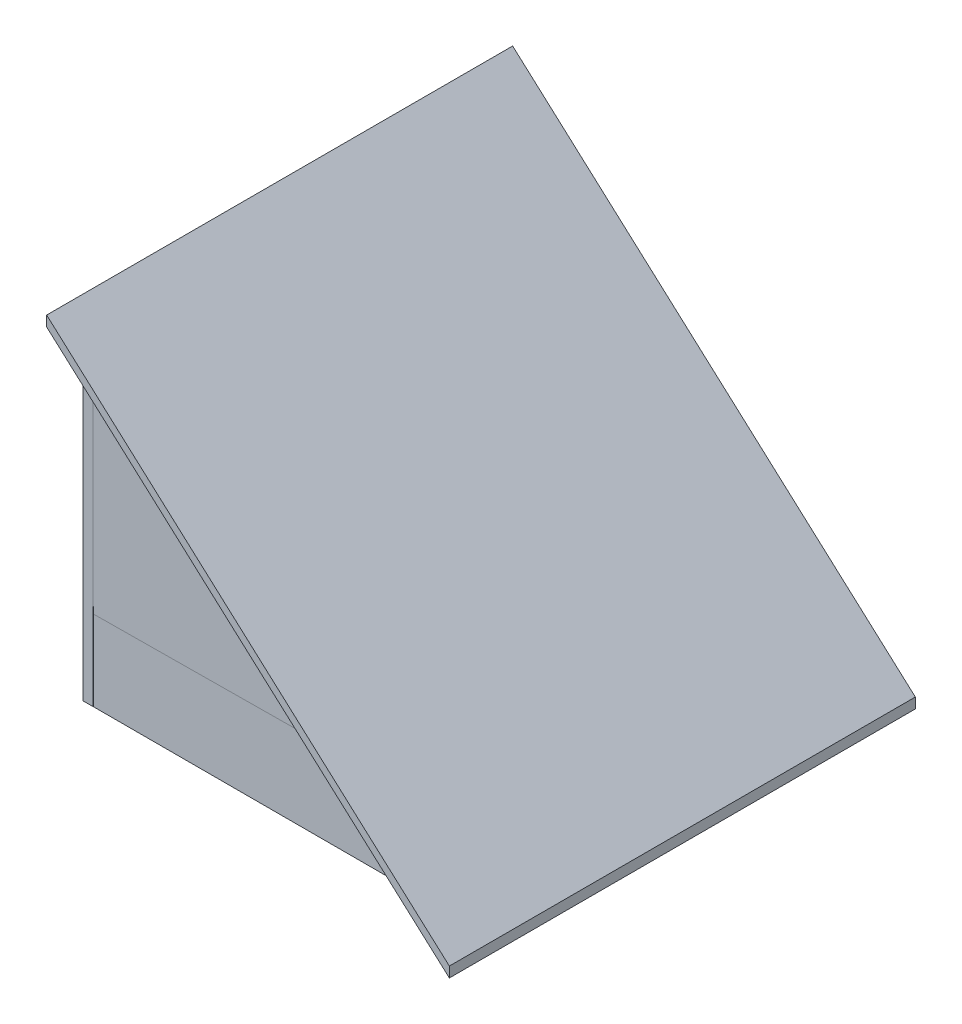
ISO-10303-21;
HEADER;
FILE_DESCRIPTION(('STEP AP214'),'2;1');
FILE_NAME('part.step','',(''),(''),'','','');
FILE_SCHEMA(('AUTOMOTIVE_DESIGN { 1 0 10303 214 1 1 1 1 }'));
ENDSEC;
DATA;
#1=APPLICATION_CONTEXT('core data for automotive mechanical design processes');
#2=APPLICATION_PROTOCOL_DEFINITION('international standard','automotive_design',2000,#1);
#3=PRODUCT_CONTEXT('',#1,'mechanical');
#4=PRODUCT('Part','Part','',(#3));
#5=PRODUCT_RELATED_PRODUCT_CATEGORY('part','',(#4));
#6=PRODUCT_DEFINITION_FORMATION('','',#4);
#7=PRODUCT_DEFINITION_CONTEXT('part definition',#1,'design');
#8=PRODUCT_DEFINITION('design','',#6,#7);
#9=PRODUCT_DEFINITION_SHAPE('','',#8);
#10=(LENGTH_UNIT() NAMED_UNIT(*) SI_UNIT(.MILLI.,.METRE.));
#11=(NAMED_UNIT(*) PLANE_ANGLE_UNIT() SI_UNIT($,.RADIAN.));
#12=(NAMED_UNIT(*) SI_UNIT($,.STERADIAN.) SOLID_ANGLE_UNIT());
#13=UNCERTAINTY_MEASURE_WITH_UNIT(LENGTH_MEASURE(1.E-05),#10,'distance_accuracy_value','');
#14=(GEOMETRIC_REPRESENTATION_CONTEXT(3) GLOBAL_UNCERTAINTY_ASSIGNED_CONTEXT((#13)) GLOBAL_UNIT_ASSIGNED_CONTEXT((#10,
#11,#12)) REPRESENTATION_CONTEXT('',''));
#15=CARTESIAN_POINT('',(0.,0.,0.));
#16=DIRECTION('',(0.,0.,1.));
#17=DIRECTION('',(1.,0.,0.));
#18=AXIS2_PLACEMENT_3D('',#15,#16,#17);
#19=CARTESIAN_POINT('',(92.8991489361703,7.62,69.8450593905439));
#20=DIRECTION('',(0.,0.,-1.));
#21=DIRECTION('',(-1.,0.,0.));
#22=AXIS2_PLACEMENT_3D('',#19,#20,#21);
#23=PLANE('',#22);
#24=DIRECTION('',(-1.,0.,0.));
#25=VECTOR('',#24,1.);
#26=CARTESIAN_POINT('',(92.8991489361703,-12.7,69.8450593905439));
#27=LINE('',#26,#25);
#28=CARTESIAN_POINT('',(92.8991489361703,-12.7,69.8450593905439));
#29=VERTEX_POINT('',#28);
#30=CARTESIAN_POINT('',(26.8591489361702,-12.7,69.8450593905439));
#31=VERTEX_POINT('',#30);
#32=EDGE_CURVE('E446',#29,#31,#27,.T.);
#33=ORIENTED_EDGE('',*,*,#32,.T.);
#34=DIRECTION('',(0.,-1.,0.));
#35=VECTOR('',#34,1.);
#36=CARTESIAN_POINT('',(26.8591489361702,7.62,69.8450593905439));
#37=LINE('',#36,#35);
#38=CARTESIAN_POINT('',(26.8591489361702,7.62,69.8450593905439));
#39=VERTEX_POINT('',#38);
#40=EDGE_CURVE('E50',#39,#31,#37,.T.);
#41=ORIENTED_EDGE('',*,*,#40,.F.);
#42=DIRECTION('',(1.,0.,0.));
#43=VECTOR('',#42,1.);
#44=CARTESIAN_POINT('',(92.8991489361703,7.62,69.8450593905439));
#45=LINE('',#44,#43);
#46=CARTESIAN_POINT('',(92.8991489361703,7.62,69.8450593905439));
#47=VERTEX_POINT('',#46);
#48=EDGE_CURVE('E443',#39,#47,#45,.T.);
#49=ORIENTED_EDGE('',*,*,#48,.T.);
#50=DIRECTION('',(0.,-1.,0.));
#51=VECTOR('',#50,1.);
#52=CARTESIAN_POINT('',(92.8991489361703,7.62,69.8450593905439));
#53=LINE('',#52,#51);
#54=EDGE_CURVE('E448',#47,#29,#53,.T.);
#55=ORIENTED_EDGE('',*,*,#54,.T.);
#56=EDGE_LOOP('',(#33,#41,#49,#55));
#57=FACE_BOUND('',#56,.T.);
#58=ADVANCED_FACE('F33',(#57),#23,.T.);
#59=CARTESIAN_POINT('',(24.3191489361702,0.,0.));
#60=DIRECTION('',(1.,0.,0.));
#61=DIRECTION('',(0.,0.,-1.));
#62=AXIS2_PLACEMENT_3D('',#59,#60,#61);
#63=PLANE('',#62);
#64=DIRECTION('',(0.,0.,-1.));
#65=VECTOR('',#64,1.);
#66=CARTESIAN_POINT('',(24.3191489361702,7.62,0.));
#67=LINE('',#66,#65);
#68=CARTESIAN_POINT('',(24.3191489361702,7.62,77.4653181557259));
#69=VERTEX_POINT('',#68);
#70=CARTESIAN_POINT('',(24.3191489361702,7.62,71.0236193905439));
#71=VERTEX_POINT('',#70);
#72=EDGE_CURVE('E417',#69,#71,#67,.T.);
#73=ORIENTED_EDGE('',*,*,#72,.T.);
#74=DIRECTION('',(0.,1.,0.));
#75=VECTOR('',#74,1.);
#76=CARTESIAN_POINT('',(24.3191489361702,7.62,71.0236193905439));
#77=LINE('',#76,#75);
#78=CARTESIAN_POINT('',(24.3191489361702,-12.7,71.0236193905439));
#79=VERTEX_POINT('',#78);
#80=EDGE_CURVE('E433',#79,#71,#77,.T.);
#81=ORIENTED_EDGE('',*,*,#80,.F.);
#82=DIRECTION('',(0.,0.,-1.));
#83=VECTOR('',#82,1.);
#84=CARTESIAN_POINT('',(24.3191489361702,-12.7,0.));
#85=LINE('',#84,#83);
#86=CARTESIAN_POINT('',(24.3191489361702,-12.7,72.2021793905439));
#87=VERTEX_POINT('',#86);
#88=EDGE_CURVE('E263',#87,#79,#85,.T.);
#89=ORIENTED_EDGE('',*,*,#88,.F.);
#90=DIRECTION('',(0.,-1.,0.));
#91=VECTOR('',#90,1.);
#92=CARTESIAN_POINT('',(24.3191489361702,-16.51,72.2021793905439));
#93=LINE('',#92,#91);
#94=CARTESIAN_POINT('',(24.3191489361702,-16.51,72.2021793905439));
#95=VERTEX_POINT('',#94);
#96=EDGE_CURVE('E411',#87,#95,#93,.T.);
#97=ORIENTED_EDGE('',*,*,#96,.T.);
#98=DIRECTION('',(0.,0.,1.));
#99=VECTOR('',#98,1.);
#100=CARTESIAN_POINT('',(24.3191489361702,-16.51,0.));
#101=LINE('',#100,#99);
#102=CARTESIAN_POINT('',(24.3191489361702,-16.51,74.7421793905439));
#103=VERTEX_POINT('',#102);
#104=EDGE_CURVE('E415',#95,#103,#101,.T.);
#105=ORIENTED_EDGE('',*,*,#104,.T.);
#106=DIRECTION('',(0.,-1.,0.));
#107=VECTOR('',#106,1.);
#108=CARTESIAN_POINT('',(24.3191489361702,-16.51,74.7421793905439));
#109=LINE('',#108,#107);
#110=CARTESIAN_POINT('',(24.3191489361702,-12.7,74.7421793905439));
#111=VERTEX_POINT('',#110);
#112=EDGE_CURVE('E384',#111,#103,#109,.T.);
#113=ORIENTED_EDGE('',*,*,#112,.F.);
#114=DIRECTION('',(0.,0.,-1.));
#115=VECTOR('',#114,1.);
#116=CARTESIAN_POINT('',(24.3191489361702,-12.7,0.));
#117=LINE('',#116,#115);
#118=CARTESIAN_POINT('',(24.3191489361702,-12.7,79.0324884998297));
#119=VERTEX_POINT('',#118);
#120=EDGE_CURVE('E58',#119,#111,#117,.T.);
#121=ORIENTED_EDGE('',*,*,#120,.F.);
#122=DIRECTION('',(0.,-1.,0.));
#123=VECTOR('',#122,1.);
#124=CARTESIAN_POINT('',(24.3191489361702,73.66,79.0324884998297));
#125=LINE('',#124,#123);
#126=CARTESIAN_POINT('',(24.3191489361702,73.66,79.0324884998297));
#127=VERTEX_POINT('',#126);
#128=EDGE_CURVE('E299',#127,#119,#125,.T.);
#129=ORIENTED_EDGE('',*,*,#128,.F.);
#130=DIRECTION('',(0.,0.,-1.));
#131=VECTOR('',#130,1.);
#132=CARTESIAN_POINT('',(24.3191489361702,73.66,80.0324884998297));
#133=LINE('',#132,#131);
#134=CARTESIAN_POINT('',(24.3191489361702,73.66,80.0324884998297));
#135=VERTEX_POINT('',#134);
#136=EDGE_CURVE('E301',#135,#127,#133,.T.);
#137=ORIENTED_EDGE('',*,*,#136,.F.);
#138=DIRECTION('',(0.,0.,1.));
#139=VECTOR('',#138,1.);
#140=CARTESIAN_POINT('',(24.3191489361703,73.66,91.4350593905439));
#141=LINE('',#140,#139);
#142=CARTESIAN_POINT('',(24.3191489361703,73.66,91.4350593905439));
#143=VERTEX_POINT('',#142);
#144=EDGE_CURVE('E11',#135,#143,#141,.T.);
#145=ORIENTED_EDGE('',*,*,#144,.T.);
#146=DIRECTION('',(0.,1.,0.));
#147=VECTOR('',#146,1.);
#148=CARTESIAN_POINT('',(24.3191489361702,-12.7,91.4350593905439));
#149=LINE('',#148,#147);
#150=CARTESIAN_POINT('',(24.3191489361703,76.2,91.4350593905439));
#151=VERTEX_POINT('',#150);
#152=EDGE_CURVE('E401',#143,#151,#149,.T.);
#153=ORIENTED_EDGE('',*,*,#152,.T.);
#154=DIRECTION('',(0.,0.,1.));
#155=VECTOR('',#154,1.);
#156=CARTESIAN_POINT('',(24.3191489361703,76.2,91.4350593905439));
#157=LINE('',#156,#155);
#158=CARTESIAN_POINT('',(24.3191489361702,76.1999999999999,-22.8649406094561));
#159=VERTEX_POINT('',#158);
#160=EDGE_CURVE('E466',#159,#151,#157,.T.);
#161=ORIENTED_EDGE('',*,*,#160,.F.);
#162=DIRECTION('',(0.,-1.,0.));
#163=VECTOR('',#162,1.);
#164=CARTESIAN_POINT('',(24.3191489361702,-12.7,-22.8649406094561));
#165=LINE('',#164,#163);
#166=CARTESIAN_POINT('',(24.3191489361702,73.6599999999999,-22.8649406094561));
#167=VERTEX_POINT('',#166);
#168=EDGE_CURVE('E397',#159,#167,#165,.T.);
#169=ORIENTED_EDGE('',*,*,#168,.T.);
#170=CARTESIAN_POINT('',(24.3191489361702,73.6599999999999,-21.594940609456));
#171=VERTEX_POINT('',#170);
#172=EDGE_CURVE('E500',#167,#171,#141,.T.);
#173=ORIENTED_EDGE('',*,*,#172,.T.);
#174=DIRECTION('',(0.,0.,-1.));
#175=VECTOR('',#174,1.);
#176=CARTESIAN_POINT('',(24.3191489361702,73.6599999999999,-21.594940609456));
#177=LINE('',#176,#175);
#178=CARTESIAN_POINT('',(24.3191489361702,73.6599999999999,-20.594940609456));
#179=VERTEX_POINT('',#178);
#180=EDGE_CURVE('E274',#179,#171,#177,.T.);
#181=ORIENTED_EDGE('',*,*,#180,.F.);
#182=DIRECTION('',(0.,1.,0.));
#183=VECTOR('',#182,1.);
#184=CARTESIAN_POINT('',(24.3191489361702,73.6599999999999,-20.594940609456));
#185=LINE('',#184,#183);
#186=CARTESIAN_POINT('',(24.3191489361702,-12.7,-20.594940609456));
#187=VERTEX_POINT('',#186);
#188=EDGE_CURVE('E265',#187,#179,#185,.T.);
#189=ORIENTED_EDGE('',*,*,#188,.F.);
#190=CARTESIAN_POINT('',(24.3191489361702,-12.7,-17.3968266094561));
#191=VERTEX_POINT('',#190);
#192=EDGE_CURVE('E418',#191,#187,#117,.T.);
#193=ORIENTED_EDGE('',*,*,#192,.F.);
#194=DIRECTION('',(0.,1.,0.));
#195=VECTOR('',#194,1.);
#196=CARTESIAN_POINT('',(24.3191489361702,-16.51,-17.3968266094561));
#197=LINE('',#196,#195);
#198=CARTESIAN_POINT('',(24.3191489361702,-16.51,-17.3968266094561));
#199=VERTEX_POINT('',#198);
#200=EDGE_CURVE('E410',#199,#191,#197,.T.);
#201=ORIENTED_EDGE('',*,*,#200,.F.);
#202=CARTESIAN_POINT('',(24.3191489361702,-16.51,-14.8568266094561));
#203=VERTEX_POINT('',#202);
#204=EDGE_CURVE('E404',#199,#203,#101,.T.);
#205=ORIENTED_EDGE('',*,*,#204,.T.);
#206=DIRECTION('',(0.,1.,0.));
#207=VECTOR('',#206,1.);
#208=CARTESIAN_POINT('',(24.3191489361702,-16.51,-14.8568266094561));
#209=LINE('',#208,#207);
#210=CARTESIAN_POINT('',(24.3191489361702,-12.7,-14.8568266094561));
#211=VERTEX_POINT('',#210);
#212=EDGE_CURVE('E414',#203,#211,#209,.T.);
#213=ORIENTED_EDGE('',*,*,#212,.T.);
#214=CARTESIAN_POINT('',(24.3191489361702,-12.7,-13.9749406094561));
#215=VERTEX_POINT('',#214);
#216=EDGE_CURVE('E383',#215,#211,#85,.T.);
#217=ORIENTED_EDGE('',*,*,#216,.F.);
#218=DIRECTION('',(0.,1.,0.));
#219=VECTOR('',#218,1.);
#220=CARTESIAN_POINT('',(24.3191489361702,7.62,-13.9749406094561));
#221=LINE('',#220,#219);
#222=CARTESIAN_POINT('',(24.3191489361702,7.62,-13.9749406094561));
#223=VERTEX_POINT('',#222);
#224=EDGE_CURVE('E425',#215,#223,#221,.T.);
#225=ORIENTED_EDGE('',*,*,#224,.T.);
#226=CARTESIAN_POINT('',(24.3191489361702,7.62,-19.0549406094561));
#227=VERTEX_POINT('',#226);
#228=EDGE_CURVE('E385',#223,#227,#67,.T.);
#229=ORIENTED_EDGE('',*,*,#228,.T.);
#230=DIRECTION('',(0.,1.,0.));
#231=VECTOR('',#230,1.);
#232=CARTESIAN_POINT('',(24.3191489361702,0.,-19.0549406094561));
#233=LINE('',#232,#231);
#234=CARTESIAN_POINT('',(24.3191489361702,73.6599999999999,-19.0549406094561));
#235=VERTEX_POINT('',#234);
#236=EDGE_CURVE('E405',#227,#235,#233,.T.);
#237=ORIENTED_EDGE('',*,*,#236,.T.);
#238=CARTESIAN_POINT('',(24.3191489361703,73.66,77.4924884998297));
#239=VERTEX_POINT('',#238);
#240=EDGE_CURVE('E42',#235,#239,#141,.T.);
#241=ORIENTED_EDGE('',*,*,#240,.T.);
#242=DIRECTION('',(0.,-0.99999991536576,-0.00041142249855091));
#243=VECTOR('',#242,1.);
#244=CARTESIAN_POINT('',(24.3191489361702,-0.0329146952814137,77.4621695741743));
#245=LINE('',#244,#243);
#246=EDGE_CURVE('E400',#239,#69,#245,.T.);
#247=ORIENTED_EDGE('',*,*,#246,.T.);
#248=EDGE_LOOP('',(#73,#81,#89,#97,#105,#113,#121,#129,#137,#145,#153,#161,#169,#173,#181,#189,
#193,#201,#205,#213,#217,#225,#229,#237,#241,#247));
#249=FACE_BOUND('',#248,.T.);
#250=ADVANCED_FACE('F35',(#249),#63,.F.);
#251=CARTESIAN_POINT('',(48.7726578112144,51.6518420124604,0.));
#252=DIRECTION('',(0.66896473162245,0.743294146247166,0.));
#253=DIRECTION('',(-0.743294146247166,0.66896473162245,0.));
#254=AXIS2_PLACEMENT_3D('',#251,#252,#253);
#255=PLANE('',#254);
#256=DIRECTION('',(-0.743294146247166,0.66896473162245,0.));
#257=VECTOR('',#256,1.);
#258=CARTESIAN_POINT('',(15.0572704831317,81.9956906077349,-21.5949406094561));
#259=LINE('',#258,#257);
#260=CARTESIAN_POINT('',(100.51914893617,5.0800000000001,-21.5949406094561));
#261=VERTEX_POINT('',#260);
#262=EDGE_CURVE('E526',#261,#171,#259,.T.);
#263=ORIENTED_EDGE('',*,*,#262,.T.);
#264=ORIENTED_EDGE('',*,*,#172,.F.);
#265=DIRECTION('',(0.743294146247166,-0.66896473162245,0.));
#266=VECTOR('',#265,1.);
#267=CARTESIAN_POINT('',(24.3191489361703,73.66,-22.8649406094561));
#268=LINE('',#267,#266);
#269=CARTESIAN_POINT('',(123.096926713948,-15.24,-22.8649406094561));
#270=VERTEX_POINT('',#269);
#271=EDGE_CURVE('E527',#167,#270,#268,.T.);
#272=ORIENTED_EDGE('',*,*,#271,.T.);
#273=DIRECTION('',(0.,0.,1.));
#274=VECTOR('',#273,1.);
#275=CARTESIAN_POINT('',(123.096926713948,-15.24,91.4350593905439));
#276=LINE('',#275,#274);
#277=CARTESIAN_POINT('',(123.096926713948,-15.24,91.4350593905439));
#278=VERTEX_POINT('',#277);
#279=EDGE_CURVE('E520',#270,#278,#276,.T.);
#280=ORIENTED_EDGE('',*,*,#279,.T.);
#281=DIRECTION('',(-0.743294146247166,0.66896473162245,0.));
#282=VECTOR('',#281,1.);
#283=CARTESIAN_POINT('',(24.3191489361703,73.66,91.4350593905439));
#284=LINE('',#283,#282);
#285=EDGE_CURVE('E508',#278,#143,#284,.T.);
#286=ORIENTED_EDGE('',*,*,#285,.T.);
#287=ORIENTED_EDGE('',*,*,#144,.F.);
#288=DIRECTION('',(-0.743294117556119,0.668964705800505,0.000277848364986755));
#289=VECTOR('',#288,1.);
#290=CARTESIAN_POINT('',(97.6969267139482,7.62,80.0050593905439));
#291=LINE('',#290,#289);
#292=CARTESIAN_POINT('',(97.6969267139481,7.62,80.0050593905439));
#293=VERTEX_POINT('',#292);
#294=EDGE_CURVE('E365',#293,#135,#291,.T.);
#295=ORIENTED_EDGE('',*,*,#294,.F.);
#296=DIRECTION('',(0.743294146247166,-0.66896473162245,0.));
#297=VECTOR('',#296,1.);
#298=CARTESIAN_POINT('',(15.0572704831317,81.9956906077349,80.0050593905439));
#299=LINE('',#298,#297);
#300=CARTESIAN_POINT('',(100.51914893617,5.0800000000001,80.0050593905439));
#301=VERTEX_POINT('',#300);
#302=EDGE_CURVE('E486',#293,#301,#299,.T.);
#303=ORIENTED_EDGE('',*,*,#302,.T.);
#304=DIRECTION('',(0.,0.,-1.));
#305=VECTOR('',#304,1.);
#306=CARTESIAN_POINT('',(100.51914893617,5.0800000000001,-21.5949406094561));
#307=LINE('',#306,#305);
#308=EDGE_CURVE('E420',#301,#261,#307,.T.);
#309=ORIENTED_EDGE('',*,*,#308,.T.);
#310=EDGE_LOOP('',(#263,#264,#272,#280,#286,#287,#295,#303,#309));
#311=FACE_BOUND('',#310,.T.);
#312=ADVANCED_FACE('F560',(#311),#255,.F.);
#313=CARTESIAN_POINT('',(0.,-12.7,0.));
#314=DIRECTION('',(0.,1.,0.));
#315=DIRECTION('',(0.,0.,1.));
#316=AXIS2_PLACEMENT_3D('',#313,#314,#315);
#317=PLANE('',#316);
#318=DIRECTION('',(-1.,0.,0.));
#319=VECTOR('',#318,1.);
#320=CARTESIAN_POINT('',(-51.8808510638297,-12.7,80.0050593905439));
#321=LINE('',#320,#319);
#322=CARTESIAN_POINT('',(100.51914893617,-12.7,80.0050593905439));
#323=VERTEX_POINT('',#322);
#324=CARTESIAN_POINT('',(24.3191489361702,-12.7,80.0050593905439));
#325=VERTEX_POINT('',#324);
#326=EDGE_CURVE('E454',#323,#325,#321,.T.);
#327=ORIENTED_EDGE('',*,*,#326,.T.);
#328=DIRECTION('',(0.,0.,1.));
#329=VECTOR('',#328,1.);
#330=CARTESIAN_POINT('',(24.3191489361702,-12.7,80.0324884998297));
#331=LINE('',#330,#329);
#332=CARTESIAN_POINT('',(24.3191489361702,-12.7,80.0324884998297));
#333=VERTEX_POINT('',#332);
#334=EDGE_CURVE('E292',#325,#333,#331,.T.);
#335=ORIENTED_EDGE('',*,*,#334,.T.);
#336=DIRECTION('',(1.,0.,0.));
#337=VECTOR('',#336,1.);
#338=CARTESIAN_POINT('',(21.7791489361702,-12.7,80.0324884998297));
#339=LINE('',#338,#337);
#340=CARTESIAN_POINT('',(21.7791489361702,-12.7,80.0324884998297));
#341=VERTEX_POINT('',#340);
#342=EDGE_CURVE('E298',#341,#333,#339,.T.);
#343=ORIENTED_EDGE('',*,*,#342,.F.);
#344=DIRECTION('',(0.,0.,1.));
#345=VECTOR('',#344,1.);
#346=CARTESIAN_POINT('',(21.7791489361702,-12.7,80.0324884998297));
#347=LINE('',#346,#345);
#348=CARTESIAN_POINT('',(21.7791489361702,-12.7,79.0324884998297));
#349=VERTEX_POINT('',#348);
#350=EDGE_CURVE('E296',#349,#341,#347,.T.);
#351=ORIENTED_EDGE('',*,*,#350,.F.);
#352=DIRECTION('',(1.,0.,0.));
#353=VECTOR('',#352,1.);
#354=CARTESIAN_POINT('',(21.7791489361702,-12.7,79.0324884998297));
#355=LINE('',#354,#353);
#356=EDGE_CURVE('E305',#349,#119,#355,.T.);
#357=ORIENTED_EDGE('',*,*,#356,.T.);
#358=ORIENTED_EDGE('',*,*,#120,.T.);
#359=DIRECTION('',(-1.,0.,0.));
#360=VECTOR('',#359,1.);
#361=CARTESIAN_POINT('',(97.4791489361702,-12.7,74.7421793905439));
#362=LINE('',#361,#360);
#363=CARTESIAN_POINT('',(97.4791489361702,-12.7,74.7421793905439));
#364=VERTEX_POINT('',#363);
#365=EDGE_CURVE('E355',#364,#111,#362,.T.);
#366=ORIENTED_EDGE('',*,*,#365,.F.);
#367=DIRECTION('',(0.,0.,1.));
#368=VECTOR('',#367,1.);
#369=CARTESIAN_POINT('',(97.4791489361702,-12.7,-17.3968266094561));
#370=LINE('',#369,#368);
#371=CARTESIAN_POINT('',(97.4791489361702,-12.7,-17.3968266094561));
#372=VERTEX_POINT('',#371);
#373=EDGE_CURVE('E342',#372,#364,#370,.T.);
#374=ORIENTED_EDGE('',*,*,#373,.F.);
#375=DIRECTION('',(1.,0.,0.));
#376=VECTOR('',#375,1.);
#377=CARTESIAN_POINT('',(97.4791489361702,-12.7,-17.3968266094561));
#378=LINE('',#377,#376);
#379=EDGE_CURVE('E347',#191,#372,#378,.T.);
#380=ORIENTED_EDGE('',*,*,#379,.F.);
#381=ORIENTED_EDGE('',*,*,#192,.T.);
#382=DIRECTION('',(1.,0.,0.));
#383=VECTOR('',#382,1.);
#384=CARTESIAN_POINT('',(21.7791489361702,-12.7,-20.594940609456));
#385=LINE('',#384,#383);
#386=CARTESIAN_POINT('',(21.7791489361702,-12.7,-20.594940609456));
#387=VERTEX_POINT('',#386);
#388=EDGE_CURVE('E285',#387,#187,#385,.T.);
#389=ORIENTED_EDGE('',*,*,#388,.F.);
#390=DIRECTION('',(0.,0.,1.));
#391=VECTOR('',#390,1.);
#392=CARTESIAN_POINT('',(21.7791489361702,-12.7,-21.594940609456));
#393=LINE('',#392,#391);
#394=CARTESIAN_POINT('',(21.7791489361702,-12.7,-21.594940609456));
#395=VERTEX_POINT('',#394);
#396=EDGE_CURVE('E273',#395,#387,#393,.T.);
#397=ORIENTED_EDGE('',*,*,#396,.F.);
#398=DIRECTION('',(1.,0.,0.));
#399=VECTOR('',#398,1.);
#400=CARTESIAN_POINT('',(-51.8808510638297,-12.7,-21.5949406094561));
#401=LINE('',#400,#399);
#402=CARTESIAN_POINT('',(100.51914893617,-12.7,-21.5949406094561));
#403=VERTEX_POINT('',#402);
#404=EDGE_CURVE('E452',#395,#403,#401,.T.);
#405=ORIENTED_EDGE('',*,*,#404,.T.);
#406=DIRECTION('',(0.,0.,1.));
#407=VECTOR('',#406,1.);
#408=CARTESIAN_POINT('',(100.51914893617,-12.7,-21.5949406094561));
#409=LINE('',#408,#407);
#410=EDGE_CURVE('E456',#403,#323,#409,.T.);
#411=ORIENTED_EDGE('',*,*,#410,.T.);
#412=EDGE_LOOP('',(#327,#335,#343,#351,#357,#358,#366,#374,#380,#381,#389,#397,#405,#411));
#413=FACE_BOUND('',#412,.T.);
#414=ADVANCED_FACE('F611',(#413),#317,.F.);
#415=CARTESIAN_POINT('',(-51.8808510638297,7.62,80.0050593905439));
#416=DIRECTION('',(0.,0.,-1.));
#417=DIRECTION('',(-1.,0.,0.));
#418=AXIS2_PLACEMENT_3D('',#415,#416,#417);
#419=PLANE('',#418);
#420=DIRECTION('',(0.999963267330155,0.00857111371997301,0.));
#421=VECTOR('',#420,1.);
#422=CARTESIAN_POINT('',(-50.4697399527186,6.34999999999996,80.0050593905439));
#423=LINE('',#422,#421);
#424=CARTESIAN_POINT('',(24.3191489361702,6.9910476190476,80.0050593905439));
#425=VERTEX_POINT('',#424);
#426=EDGE_CURVE('E368',#425,#293,#423,.T.);
#427=ORIENTED_EDGE('',*,*,#426,.F.);
#428=DIRECTION('',(0.,-1.,0.));
#429=VECTOR('',#428,1.);
#430=CARTESIAN_POINT('',(24.3191489361702,7.62,80.0050593905439));
#431=LINE('',#430,#429);
#432=EDGE_CURVE('E390',#425,#325,#431,.T.);
#433=ORIENTED_EDGE('',*,*,#432,.T.);
#434=ORIENTED_EDGE('',*,*,#326,.F.);
#435=DIRECTION('',(0.,-1.,0.));
#436=VECTOR('',#435,1.);
#437=CARTESIAN_POINT('',(100.51914893617,7.62,80.0050593905439));
#438=LINE('',#437,#436);
#439=EDGE_CURVE('E479',#301,#323,#438,.T.);
#440=ORIENTED_EDGE('',*,*,#439,.F.);
#441=ORIENTED_EDGE('',*,*,#302,.F.);
#442=EDGE_LOOP('',(#427,#433,#434,#440,#441));
#443=FACE_BOUND('',#442,.T.);
#444=ADVANCED_FACE('F604',(#443),#419,.F.);
#445=CARTESIAN_POINT('',(0.,7.62,0.));
#446=DIRECTION('',(0.,1.,0.));
#447=DIRECTION('',(0.,0.,1.));
#448=AXIS2_PLACEMENT_3D('',#445,#446,#447);
#449=PLANE('',#448);
#450=DIRECTION('',(-1.,0.,0.));
#451=VECTOR('',#450,1.);
#452=CARTESIAN_POINT('',(26.8591489361702,7.62,71.0236193905439));
#453=LINE('',#452,#451);
#454=CARTESIAN_POINT('',(26.8591489361702,7.62,71.0236193905439));
#455=VERTEX_POINT('',#454);
#456=EDGE_CURVE('E249',#455,#71,#453,.T.);
#457=ORIENTED_EDGE('',*,*,#456,.T.);
#458=ORIENTED_EDGE('',*,*,#72,.F.);
#459=DIRECTION('',(-0.999999999993782,0.,3.52647885741862E-06));
#460=VECTOR('',#459,1.);
#461=CARTESIAN_POINT('',(0.000273180109091904,7.62,77.4654039157271));
#462=LINE('',#461,#460);
#463=CARTESIAN_POINT('',(97.6969267139482,7.62,77.4650593905439));
#464=VERTEX_POINT('',#463);
#465=EDGE_CURVE('E377',#464,#69,#462,.T.);
#466=ORIENTED_EDGE('',*,*,#465,.F.);
#467=DIRECTION('',(0.,0.,-1.));
#468=VECTOR('',#467,1.);
#469=CARTESIAN_POINT('',(97.6969267139482,7.62,0.));
#470=LINE('',#469,#468);
#471=CARTESIAN_POINT('',(97.6969267139482,7.62,-19.0549406094561));
#472=VERTEX_POINT('',#471);
#473=EDGE_CURVE('E483',#464,#472,#470,.T.);
#474=ORIENTED_EDGE('',*,*,#473,.T.);
#475=DIRECTION('',(-1.,0.,0.));
#476=VECTOR('',#475,1.);
#477=CARTESIAN_POINT('',(97.6969267139482,7.62,-19.0549406094561));
#478=LINE('',#477,#476);
#479=EDGE_CURVE('E316',#472,#227,#478,.T.);
#480=ORIENTED_EDGE('',*,*,#479,.T.);
#481=ORIENTED_EDGE('',*,*,#228,.F.);
#482=DIRECTION('',(-1.,0.,0.));
#483=VECTOR('',#482,1.);
#484=CARTESIAN_POINT('',(-44.2608510638297,7.62,-13.9749406094561));
#485=LINE('',#484,#483);
#486=CARTESIAN_POINT('',(92.8991489361703,7.62,-13.9749406094561));
#487=VERTEX_POINT('',#486);
#488=EDGE_CURVE('E470',#487,#223,#485,.T.);
#489=ORIENTED_EDGE('',*,*,#488,.F.);
#490=DIRECTION('',(0.,0.,-1.));
#491=VECTOR('',#490,1.);
#492=CARTESIAN_POINT('',(92.8991489361703,7.62,-13.9749406094561));
#493=LINE('',#492,#491);
#494=EDGE_CURVE('E468',#47,#487,#493,.T.);
#495=ORIENTED_EDGE('',*,*,#494,.F.);
#496=ORIENTED_EDGE('',*,*,#48,.F.);
#497=DIRECTION('',(0.,0.,-1.));
#498=VECTOR('',#497,1.);
#499=CARTESIAN_POINT('',(26.8591489361702,7.62,69.8450593905439));
#500=LINE('',#499,#498);
#501=EDGE_CURVE('E251',#455,#39,#500,.T.);
#502=ORIENTED_EDGE('',*,*,#501,.F.);
#503=EDGE_LOOP('',(#457,#458,#466,#474,#480,#481,#489,#495,#496,#502));
#504=FACE_BOUND('',#503,.T.);
#505=ADVANCED_FACE('F438',(#504),#449,.T.);
#506=CARTESIAN_POINT('',(-51.8808510638297,7.62,-21.5949406094561));
#507=DIRECTION('',(0.,0.,1.));
#508=DIRECTION('',(1.,0.,0.));
#509=AXIS2_PLACEMENT_3D('',#506,#507,#508);
#510=PLANE('',#509);
#511=ORIENTED_EDGE('',*,*,#404,.F.);
#512=DIRECTION('',(0.,-1.,0.));
#513=VECTOR('',#512,1.);
#514=CARTESIAN_POINT('',(21.7791489361702,73.6599999999999,-21.594940609456));
#515=LINE('',#514,#513);
#516=CARTESIAN_POINT('',(21.7791489361702,73.6599999999999,-21.594940609456));
#517=VERTEX_POINT('',#516);
#518=EDGE_CURVE('E270',#517,#395,#515,.T.);
#519=ORIENTED_EDGE('',*,*,#518,.F.);
#520=DIRECTION('',(1.,0.,0.));
#521=VECTOR('',#520,1.);
#522=CARTESIAN_POINT('',(21.7791489361702,73.6599999999999,-21.594940609456));
#523=LINE('',#522,#521);
#524=EDGE_CURVE('E280',#517,#171,#523,.T.);
#525=ORIENTED_EDGE('',*,*,#524,.T.);
#526=ORIENTED_EDGE('',*,*,#262,.F.);
#527=DIRECTION('',(0.,-1.,0.));
#528=VECTOR('',#527,1.);
#529=CARTESIAN_POINT('',(100.51914893617,7.62,-21.5949406094561));
#530=LINE('',#529,#528);
#531=EDGE_CURVE('E476',#261,#403,#530,.T.);
#532=ORIENTED_EDGE('',*,*,#531,.T.);
#533=EDGE_LOOP('',(#511,#519,#525,#526,#532));
#534=FACE_BOUND('',#533,.T.);
#535=ADVANCED_FACE('F615',(#534),#510,.F.);
#536=CARTESIAN_POINT('',(100.51914893617,7.62,-21.5949406094561));
#537=DIRECTION('',(-1.,0.,0.));
#538=DIRECTION('',(0.,0.,1.));
#539=AXIS2_PLACEMENT_3D('',#536,#537,#538);
#540=PLANE('',#539);
#541=ORIENTED_EDGE('',*,*,#308,.F.);
#542=ORIENTED_EDGE('',*,*,#439,.T.);
#543=ORIENTED_EDGE('',*,*,#410,.F.);
#544=ORIENTED_EDGE('',*,*,#531,.F.);
#545=EDGE_LOOP('',(#541,#542,#543,#544));
#546=FACE_BOUND('',#545,.T.);
#547=ADVANCED_FACE('F609',(#546),#540,.F.);
#548=CARTESIAN_POINT('',(92.8991489361703,7.62,-13.9749406094561));
#549=DIRECTION('',(-1.,0.,0.));
#550=DIRECTION('',(0.,0.,1.));
#551=AXIS2_PLACEMENT_3D('',#548,#549,#550);
#552=PLANE('',#551);
#553=DIRECTION('',(0.,-1.,0.));
#554=VECTOR('',#553,1.);
#555=CARTESIAN_POINT('',(92.8991489361703,7.62,-13.9749406094561));
#556=LINE('',#555,#554);
#557=CARTESIAN_POINT('',(92.8991489361703,-12.7,-13.9749406094561));
#558=VERTEX_POINT('',#557);
#559=EDGE_CURVE('E472',#487,#558,#556,.T.);
#560=ORIENTED_EDGE('',*,*,#559,.T.);
#561=DIRECTION('',(0.,0.,1.));
#562=VECTOR('',#561,1.);
#563=CARTESIAN_POINT('',(92.8991489361703,-12.7,-13.9749406094561));
#564=LINE('',#563,#562);
#565=EDGE_CURVE('E463',#558,#29,#564,.T.);
#566=ORIENTED_EDGE('',*,*,#565,.T.);
#567=ORIENTED_EDGE('',*,*,#54,.F.);
#568=ORIENTED_EDGE('',*,*,#494,.T.);
#569=EDGE_LOOP('',(#560,#566,#567,#568));
#570=FACE_BOUND('',#569,.T.);
#571=ADVANCED_FACE('F622',(#570),#552,.T.);
#572=CARTESIAN_POINT('',(-44.2608510638297,7.62,-13.9749406094561));
#573=DIRECTION('',(0.,0.,1.));
#574=DIRECTION('',(1.,0.,0.));
#575=AXIS2_PLACEMENT_3D('',#572,#573,#574);
#576=PLANE('',#575);
#577=ORIENTED_EDGE('',*,*,#224,.F.);
#578=DIRECTION('',(1.,0.,0.));
#579=VECTOR('',#578,1.);
#580=CARTESIAN_POINT('',(-44.2608510638297,-12.7,-13.9749406094561));
#581=LINE('',#580,#579);
#582=EDGE_CURVE('E451',#215,#558,#581,.T.);
#583=ORIENTED_EDGE('',*,*,#582,.T.);
#584=ORIENTED_EDGE('',*,*,#559,.F.);
#585=ORIENTED_EDGE('',*,*,#488,.T.);
#586=EDGE_LOOP('',(#577,#583,#584,#585));
#587=FACE_BOUND('',#586,.T.);
#588=ADVANCED_FACE('F634',(#587),#576,.T.);
#589=ORIENTED_EDGE('',*,*,#88,.T.);
#590=DIRECTION('',(-1.,0.,0.));
#591=VECTOR('',#590,1.);
#592=CARTESIAN_POINT('',(26.8591489361702,-12.7,71.0236193905439));
#593=LINE('',#592,#591);
#594=CARTESIAN_POINT('',(26.8591489361702,-12.7,71.0236193905439));
#595=VERTEX_POINT('',#594);
#596=EDGE_CURVE('E246',#595,#79,#593,.T.);
#597=ORIENTED_EDGE('',*,*,#596,.F.);
#598=DIRECTION('',(0.,0.,1.));
#599=VECTOR('',#598,1.);
#600=CARTESIAN_POINT('',(26.8591489361702,-12.7,69.8450593905439));
#601=LINE('',#600,#599);
#602=EDGE_CURVE('E252',#31,#595,#601,.T.);
#603=ORIENTED_EDGE('',*,*,#602,.F.);
#604=ORIENTED_EDGE('',*,*,#32,.F.);
#605=ORIENTED_EDGE('',*,*,#565,.F.);
#606=ORIENTED_EDGE('',*,*,#582,.F.);
#607=ORIENTED_EDGE('',*,*,#216,.T.);
#608=DIRECTION('',(1.,0.,0.));
#609=VECTOR('',#608,1.);
#610=CARTESIAN_POINT('',(94.9391489361702,-12.7,-14.8568266094561));
#611=LINE('',#610,#609);
#612=CARTESIAN_POINT('',(94.9391489361702,-12.7,-14.8568266094561));
#613=VERTEX_POINT('',#612);
#614=EDGE_CURVE('E326',#211,#613,#611,.T.);
#615=ORIENTED_EDGE('',*,*,#614,.T.);
#616=DIRECTION('',(0.,0.,1.));
#617=VECTOR('',#616,1.);
#618=CARTESIAN_POINT('',(94.9391489361702,-12.7,-14.8568266094561));
#619=LINE('',#618,#617);
#620=CARTESIAN_POINT('',(94.9391489361702,-12.7,72.2021793905439));
#621=VERTEX_POINT('',#620);
#622=EDGE_CURVE('E315',#613,#621,#619,.T.);
#623=ORIENTED_EDGE('',*,*,#622,.T.);
#624=DIRECTION('',(-1.,0.,0.));
#625=VECTOR('',#624,1.);
#626=CARTESIAN_POINT('',(94.9391489361702,-12.7,72.2021793905439));
#627=LINE('',#626,#625);
#628=EDGE_CURVE('E334',#621,#87,#627,.T.);
#629=ORIENTED_EDGE('',*,*,#628,.T.);
#630=EDGE_LOOP('',(#589,#597,#603,#604,#605,#606,#607,#615,#623,#629));
#631=FACE_BOUND('',#630,.T.);
#632=ADVANCED_FACE('F260',(#631),#317,.F.);
#633=CARTESIAN_POINT('',(-74.4586288416075,-12.7,91.4350593905439));
#634=DIRECTION('',(0.,0.,1.));
#635=DIRECTION('',(1.,0.,0.));
#636=AXIS2_PLACEMENT_3D('',#633,#634,#635);
#637=PLANE('',#636);
#638=ORIENTED_EDGE('',*,*,#152,.F.);
#639=ORIENTED_EDGE('',*,*,#285,.F.);
#640=DIRECTION('',(0.,-1.,0.));
#641=VECTOR('',#640,1.);
#642=CARTESIAN_POINT('',(123.096926713948,-12.7,91.4350593905439));
#643=LINE('',#642,#641);
#644=CARTESIAN_POINT('',(123.096926713948,-12.7,91.4350593905439));
#645=VERTEX_POINT('',#644);
#646=EDGE_CURVE('E511',#645,#278,#643,.T.);
#647=ORIENTED_EDGE('',*,*,#646,.F.);
#648=DIRECTION('',(-0.743294146247166,0.66896473162245,0.));
#649=VECTOR('',#648,1.);
#650=CARTESIAN_POINT('',(24.3191489361703,76.2,91.4350593905439));
#651=LINE('',#650,#649);
#652=EDGE_CURVE('E517',#645,#151,#651,.T.);
#653=ORIENTED_EDGE('',*,*,#652,.T.);
#654=EDGE_LOOP('',(#638,#639,#647,#653));
#655=FACE_BOUND('',#654,.T.);
#656=ADVANCED_FACE('F556',(#655),#637,.T.);
#657=CARTESIAN_POINT('',(-74.4586288416075,-12.7,-22.8649406094561));
#658=DIRECTION('',(0.,0.,-1.));
#659=DIRECTION('',(-1.,0.,0.));
#660=AXIS2_PLACEMENT_3D('',#657,#658,#659);
#661=PLANE('',#660);
#662=ORIENTED_EDGE('',*,*,#168,.F.);
#663=DIRECTION('',(0.743294146247166,-0.66896473162245,0.));
#664=VECTOR('',#663,1.);
#665=CARTESIAN_POINT('',(24.3191489361703,76.2,-22.8649406094561));
#666=LINE('',#665,#664);
#667=CARTESIAN_POINT('',(123.096926713948,-12.7,-22.8649406094561));
#668=VERTEX_POINT('',#667);
#669=EDGE_CURVE('E523',#159,#668,#666,.T.);
#670=ORIENTED_EDGE('',*,*,#669,.T.);
#671=DIRECTION('',(0.,-1.,0.));
#672=VECTOR('',#671,1.);
#673=CARTESIAN_POINT('',(123.096926713948,-12.7,-22.8649406094561));
#674=LINE('',#673,#672);
#675=EDGE_CURVE('E536',#668,#270,#674,.T.);
#676=ORIENTED_EDGE('',*,*,#675,.T.);
#677=ORIENTED_EDGE('',*,*,#271,.F.);
#678=EDGE_LOOP('',(#662,#670,#676,#677));
#679=FACE_BOUND('',#678,.T.);
#680=ADVANCED_FACE('F564',(#679),#661,.T.);
#681=ORIENTED_EDGE('',*,*,#240,.F.);
#682=DIRECTION('',(0.743294146247168,-0.668964731622448,0.));
#683=VECTOR('',#682,1.);
#684=CARTESIAN_POINT('',(24.3191489361702,73.6599999999999,-19.0549406094561));
#685=LINE('',#684,#683);
#686=EDGE_CURVE('E312',#235,#472,#685,.T.);
#687=ORIENTED_EDGE('',*,*,#686,.T.);
#688=ORIENTED_EDGE('',*,*,#473,.F.);
#689=DIRECTION('',(-0.743294117556119,0.668964705800505,0.000277848364986755));
#690=VECTOR('',#689,1.);
#691=CARTESIAN_POINT('',(97.6969267139482,7.62,77.4650593905439));
#692=LINE('',#691,#690);
#693=EDGE_CURVE('E364',#464,#239,#692,.T.);
#694=ORIENTED_EDGE('',*,*,#693,.T.);
#695=EDGE_LOOP('',(#681,#687,#688,#694));
#696=FACE_BOUND('',#695,.T.);
#697=ADVANCED_FACE('F505',(#696),#255,.F.);
#698=CARTESIAN_POINT('',(48.7726578112144,54.1918420124604,0.));
#699=DIRECTION('',(0.66896473162245,0.743294146247166,0.));
#700=DIRECTION('',(-0.743294146247166,0.66896473162245,0.));
#701=AXIS2_PLACEMENT_3D('',#698,#699,#700);
#702=PLANE('',#701);
#703=ORIENTED_EDGE('',*,*,#160,.T.);
#704=ORIENTED_EDGE('',*,*,#652,.F.);
#705=DIRECTION('',(0.,0.,1.));
#706=VECTOR('',#705,1.);
#707=CARTESIAN_POINT('',(123.096926713948,-12.7,91.4350593905439));
#708=LINE('',#707,#706);
#709=EDGE_CURVE('E533',#668,#645,#708,.T.);
#710=ORIENTED_EDGE('',*,*,#709,.F.);
#711=ORIENTED_EDGE('',*,*,#669,.F.);
#712=EDGE_LOOP('',(#703,#704,#710,#711));
#713=FACE_BOUND('',#712,.T.);
#714=ADVANCED_FACE('F568',(#713),#702,.T.);
#715=CARTESIAN_POINT('',(123.096926713948,-12.7,91.4350593905439));
#716=DIRECTION('',(1.,0.,0.));
#717=DIRECTION('',(0.,0.,-1.));
#718=AXIS2_PLACEMENT_3D('',#715,#716,#717);
#719=PLANE('',#718);
#720=ORIENTED_EDGE('',*,*,#279,.F.);
#721=ORIENTED_EDGE('',*,*,#675,.F.);
#722=ORIENTED_EDGE('',*,*,#709,.T.);
#723=ORIENTED_EDGE('',*,*,#646,.T.);
#724=EDGE_LOOP('',(#720,#721,#722,#723));
#725=FACE_BOUND('',#724,.T.);
#726=ADVANCED_FACE('F552',(#725),#719,.T.);
#727=CARTESIAN_POINT('',(0.000282126261983368,-0.0329147305649886,80.0022553341294));
#728=DIRECTION('',(-3.52647855895777E-06,0.000411422498548352,-0.999999915359542));
#729=DIRECTION('',(0.,0.99999991536576,0.00041142249855091));
#730=AXIS2_PLACEMENT_3D('',#727,#728,#729);
#731=PLANE('',#730);
#732=ORIENTED_EDGE('',*,*,#294,.T.);
#733=DIRECTION('',(0.,-0.99999991536576,-0.00041142249855091));
#734=VECTOR('',#733,1.);
#735=CARTESIAN_POINT('',(24.3191489361702,-0.0329146952814106,80.0021695741743));
#736=LINE('',#735,#734);
#737=EDGE_CURVE('E380',#135,#425,#736,.T.);
#738=ORIENTED_EDGE('',*,*,#737,.T.);
#739=ORIENTED_EDGE('',*,*,#426,.T.);
#740=EDGE_LOOP('',(#732,#738,#739));
#741=FACE_BOUND('',#740,.T.);
#742=ADVANCED_FACE('F647',(#741),#731,.F.);
#743=CARTESIAN_POINT('',(0.000282126261980978,-0.0329147305649917,77.4622553341294));
#744=DIRECTION('',(-3.52647855895777E-06,0.000411422498548352,-0.999999915359542));
#745=DIRECTION('',(0.,0.99999991536576,0.00041142249855091));
#746=AXIS2_PLACEMENT_3D('',#743,#744,#745);
#747=PLANE('',#746);
#748=ORIENTED_EDGE('',*,*,#246,.F.);
#749=ORIENTED_EDGE('',*,*,#693,.F.);
#750=ORIENTED_EDGE('',*,*,#465,.T.);
#751=EDGE_LOOP('',(#748,#749,#750));
#752=FACE_BOUND('',#751,.T.);
#753=ADVANCED_FACE('F507',(#752),#747,.T.);
#754=CARTESIAN_POINT('',(0.,-16.51,0.));
#755=DIRECTION('',(0.,-1.,0.));
#756=DIRECTION('',(0.,0.,-1.));
#757=AXIS2_PLACEMENT_3D('',#754,#755,#756);
#758=PLANE('',#757);
#759=ORIENTED_EDGE('',*,*,#204,.F.);
#760=DIRECTION('',(1.,0.,0.));
#761=VECTOR('',#760,1.);
#762=CARTESIAN_POINT('',(97.4791489361702,-16.51,-17.3968266094561));
#763=LINE('',#762,#761);
#764=CARTESIAN_POINT('',(97.4791489361702,-16.51,-17.3968266094561));
#765=VERTEX_POINT('',#764);
#766=EDGE_CURVE('E350',#199,#765,#763,.T.);
#767=ORIENTED_EDGE('',*,*,#766,.T.);
#768=DIRECTION('',(0.,0.,1.));
#769=VECTOR('',#768,1.);
#770=CARTESIAN_POINT('',(97.4791489361702,-16.51,-17.3968266094561));
#771=LINE('',#770,#769);
#772=CARTESIAN_POINT('',(97.4791489361702,-16.51,74.7421793905439));
#773=VERTEX_POINT('',#772);
#774=EDGE_CURVE('E343',#765,#773,#771,.T.);
#775=ORIENTED_EDGE('',*,*,#774,.T.);
#776=DIRECTION('',(-1.,0.,0.));
#777=VECTOR('',#776,1.);
#778=CARTESIAN_POINT('',(97.4791489361702,-16.51,74.7421793905439));
#779=LINE('',#778,#777);
#780=EDGE_CURVE('E346',#773,#103,#779,.T.);
#781=ORIENTED_EDGE('',*,*,#780,.T.);
#782=ORIENTED_EDGE('',*,*,#104,.F.);
#783=DIRECTION('',(-1.,0.,0.));
#784=VECTOR('',#783,1.);
#785=CARTESIAN_POINT('',(94.9391489361702,-16.51,72.2021793905439));
#786=LINE('',#785,#784);
#787=CARTESIAN_POINT('',(94.9391489361702,-16.51,72.2021793905439));
#788=VERTEX_POINT('',#787);
#789=EDGE_CURVE('E325',#788,#95,#786,.T.);
#790=ORIENTED_EDGE('',*,*,#789,.F.);
#791=DIRECTION('',(0.,0.,1.));
#792=VECTOR('',#791,1.);
#793=CARTESIAN_POINT('',(94.9391489361702,-16.51,-14.8568266094561));
#794=LINE('',#793,#792);
#795=CARTESIAN_POINT('',(94.9391489361702,-16.51,-14.8568266094561));
#796=VERTEX_POINT('',#795);
#797=EDGE_CURVE('E323',#796,#788,#794,.T.);
#798=ORIENTED_EDGE('',*,*,#797,.F.);
#799=DIRECTION('',(1.,0.,0.));
#800=VECTOR('',#799,1.);
#801=CARTESIAN_POINT('',(94.9391489361702,-16.51,-14.8568266094561));
#802=LINE('',#801,#800);
#803=EDGE_CURVE('E329',#203,#796,#802,.T.);
#804=ORIENTED_EDGE('',*,*,#803,.F.);
#805=EDGE_LOOP('',(#759,#767,#775,#781,#782,#790,#798,#804));
#806=FACE_BOUND('',#805,.T.);
#807=ADVANCED_FACE('F654',(#806),#758,.T.);
#808=CARTESIAN_POINT('',(97.4791489361702,-16.51,-17.3968266094561));
#809=DIRECTION('',(-1.,0.,0.));
#810=DIRECTION('',(0.,0.,1.));
#811=AXIS2_PLACEMENT_3D('',#808,#809,#810);
#812=PLANE('',#811);
#813=ORIENTED_EDGE('',*,*,#373,.T.);
#814=DIRECTION('',(0.,1.,0.));
#815=VECTOR('',#814,1.);
#816=CARTESIAN_POINT('',(97.4791489361702,-16.51,74.7421793905439));
#817=LINE('',#816,#815);
#818=EDGE_CURVE('E361',#773,#364,#817,.T.);
#819=ORIENTED_EDGE('',*,*,#818,.F.);
#820=ORIENTED_EDGE('',*,*,#774,.F.);
#821=DIRECTION('',(0.,1.,0.));
#822=VECTOR('',#821,1.);
#823=CARTESIAN_POINT('',(97.4791489361702,-16.51,-17.3968266094561));
#824=LINE('',#823,#822);
#825=EDGE_CURVE('E352',#765,#372,#824,.T.);
#826=ORIENTED_EDGE('',*,*,#825,.T.);
#827=EDGE_LOOP('',(#813,#819,#820,#826));
#828=FACE_BOUND('',#827,.T.);
#829=ADVANCED_FACE('F658',(#828),#812,.F.);
#830=CARTESIAN_POINT('',(97.4791489361702,-16.51,74.7421793905439));
#831=DIRECTION('',(0.,0.,-1.));
#832=DIRECTION('',(-1.,0.,0.));
#833=AXIS2_PLACEMENT_3D('',#830,#831,#832);
#834=PLANE('',#833);
#835=ORIENTED_EDGE('',*,*,#365,.T.);
#836=ORIENTED_EDGE('',*,*,#112,.T.);
#837=ORIENTED_EDGE('',*,*,#780,.F.);
#838=ORIENTED_EDGE('',*,*,#818,.T.);
#839=EDGE_LOOP('',(#835,#836,#837,#838));
#840=FACE_BOUND('',#839,.T.);
#841=ADVANCED_FACE('F661',(#840),#834,.F.);
#842=CARTESIAN_POINT('',(97.4791489361702,-16.51,-17.3968266094561));
#843=DIRECTION('',(0.,0.,1.));
#844=DIRECTION('',(1.,0.,0.));
#845=AXIS2_PLACEMENT_3D('',#842,#843,#844);
#846=PLANE('',#845);
#847=ORIENTED_EDGE('',*,*,#766,.F.);
#848=ORIENTED_EDGE('',*,*,#200,.T.);
#849=ORIENTED_EDGE('',*,*,#379,.T.);
#850=ORIENTED_EDGE('',*,*,#825,.F.);
#851=EDGE_LOOP('',(#847,#848,#849,#850));
#852=FACE_BOUND('',#851,.T.);
#853=ADVANCED_FACE('F665',(#852),#846,.F.);
#854=CARTESIAN_POINT('',(94.9391489361702,-16.51,-14.8568266094561));
#855=DIRECTION('',(-1.,0.,0.));
#856=DIRECTION('',(0.,0.,1.));
#857=AXIS2_PLACEMENT_3D('',#854,#855,#856);
#858=PLANE('',#857);
#859=ORIENTED_EDGE('',*,*,#622,.F.);
#860=DIRECTION('',(0.,1.,0.));
#861=VECTOR('',#860,1.);
#862=CARTESIAN_POINT('',(94.9391489361702,-16.51,-14.8568266094561));
#863=LINE('',#862,#861);
#864=EDGE_CURVE('E331',#796,#613,#863,.T.);
#865=ORIENTED_EDGE('',*,*,#864,.F.);
#866=ORIENTED_EDGE('',*,*,#797,.T.);
#867=DIRECTION('',(0.,1.,0.));
#868=VECTOR('',#867,1.);
#869=CARTESIAN_POINT('',(94.9391489361702,-16.51,72.2021793905439));
#870=LINE('',#869,#868);
#871=EDGE_CURVE('E339',#788,#621,#870,.T.);
#872=ORIENTED_EDGE('',*,*,#871,.T.);
#873=EDGE_LOOP('',(#859,#865,#866,#872));
#874=FACE_BOUND('',#873,.T.);
#875=ADVANCED_FACE('F669',(#874),#858,.T.);
#876=CARTESIAN_POINT('',(94.9391489361702,-16.51,72.2021793905439));
#877=DIRECTION('',(0.,0.,-1.));
#878=DIRECTION('',(-1.,0.,0.));
#879=AXIS2_PLACEMENT_3D('',#876,#877,#878);
#880=PLANE('',#879);
#881=ORIENTED_EDGE('',*,*,#96,.F.);
#882=ORIENTED_EDGE('',*,*,#628,.F.);
#883=ORIENTED_EDGE('',*,*,#871,.F.);
#884=ORIENTED_EDGE('',*,*,#789,.T.);
#885=EDGE_LOOP('',(#881,#882,#883,#884));
#886=FACE_BOUND('',#885,.T.);
#887=ADVANCED_FACE('F676',(#886),#880,.T.);
#888=CARTESIAN_POINT('',(94.9391489361702,-16.51,-14.8568266094561));
#889=DIRECTION('',(0.,0.,1.));
#890=DIRECTION('',(1.,0.,0.));
#891=AXIS2_PLACEMENT_3D('',#888,#889,#890);
#892=PLANE('',#891);
#893=ORIENTED_EDGE('',*,*,#212,.F.);
#894=ORIENTED_EDGE('',*,*,#803,.T.);
#895=ORIENTED_EDGE('',*,*,#864,.T.);
#896=ORIENTED_EDGE('',*,*,#614,.F.);
#897=EDGE_LOOP('',(#893,#894,#895,#896));
#898=FACE_BOUND('',#897,.T.);
#899=ADVANCED_FACE('F680',(#898),#892,.T.);
#900=CARTESIAN_POINT('',(0.,0.,-19.0549406094561));
#901=DIRECTION('',(0.,0.,1.));
#902=DIRECTION('',(1.,0.,0.));
#903=AXIS2_PLACEMENT_3D('',#900,#901,#902);
#904=PLANE('',#903);
#905=ORIENTED_EDGE('',*,*,#236,.F.);
#906=ORIENTED_EDGE('',*,*,#479,.F.);
#907=ORIENTED_EDGE('',*,*,#686,.F.);
#908=EDGE_LOOP('',(#905,#906,#907));
#909=FACE_BOUND('',#908,.T.);
#910=ADVANCED_FACE('F630',(#909),#904,.T.);
#911=CARTESIAN_POINT('',(24.3191489361702,0.,0.));
#912=DIRECTION('',(1.,0.,0.));
#913=DIRECTION('',(0.,0.,-1.));
#914=AXIS2_PLACEMENT_3D('',#911,#912,#913);
#915=PLANE('',#914);
#916=ORIENTED_EDGE('',*,*,#432,.F.);
#917=ORIENTED_EDGE('',*,*,#737,.F.);
#918=DIRECTION('',(0.,1.,0.));
#919=VECTOR('',#918,1.);
#920=CARTESIAN_POINT('',(24.3191489361702,73.66,80.0324884998297));
#921=LINE('',#920,#919);
#922=EDGE_CURVE('E287',#333,#135,#921,.T.);
#923=ORIENTED_EDGE('',*,*,#922,.F.);
#924=ORIENTED_EDGE('',*,*,#334,.F.);
#925=EDGE_LOOP('',(#916,#917,#923,#924));
#926=FACE_BOUND('',#925,.T.);
#927=ADVANCED_FACE('F687',(#926),#915,.T.);
#928=CARTESIAN_POINT('',(21.7791489361702,73.66,80.0324884998297));
#929=DIRECTION('',(0.,0.,-1.));
#930=DIRECTION('',(-1.,0.,0.));
#931=AXIS2_PLACEMENT_3D('',#928,#929,#930);
#932=PLANE('',#931);
#933=ORIENTED_EDGE('',*,*,#922,.T.);
#934=DIRECTION('',(1.,0.,0.));
#935=VECTOR('',#934,1.);
#936=CARTESIAN_POINT('',(21.7791489361702,73.66,80.0324884998297));
#937=LINE('',#936,#935);
#938=CARTESIAN_POINT('',(21.7791489361702,73.66,80.0324884998297));
#939=VERTEX_POINT('',#938);
#940=EDGE_CURVE('E311',#939,#135,#937,.T.);
#941=ORIENTED_EDGE('',*,*,#940,.F.);
#942=DIRECTION('',(0.,1.,0.));
#943=VECTOR('',#942,1.);
#944=CARTESIAN_POINT('',(21.7791489361702,73.66,80.0324884998297));
#945=LINE('',#944,#943);
#946=EDGE_CURVE('E288',#341,#939,#945,.T.);
#947=ORIENTED_EDGE('',*,*,#946,.F.);
#948=ORIENTED_EDGE('',*,*,#342,.T.);
#949=EDGE_LOOP('',(#933,#941,#947,#948));
#950=FACE_BOUND('',#949,.T.);
#951=ADVANCED_FACE('F689',(#950),#932,.F.);
#952=CARTESIAN_POINT('',(21.7791489361702,73.66,80.0324884998297));
#953=DIRECTION('',(0.,-1.,0.));
#954=DIRECTION('',(0.,0.,-1.));
#955=AXIS2_PLACEMENT_3D('',#952,#953,#954);
#956=PLANE('',#955);
#957=ORIENTED_EDGE('',*,*,#136,.T.);
#958=DIRECTION('',(1.,0.,0.));
#959=VECTOR('',#958,1.);
#960=CARTESIAN_POINT('',(21.7791489361702,73.66,79.0324884998297));
#961=LINE('',#960,#959);
#962=CARTESIAN_POINT('',(21.7791489361702,73.66,79.0324884998297));
#963=VERTEX_POINT('',#962);
#964=EDGE_CURVE('E308',#963,#127,#961,.T.);
#965=ORIENTED_EDGE('',*,*,#964,.F.);
#966=DIRECTION('',(0.,0.,-1.));
#967=VECTOR('',#966,1.);
#968=CARTESIAN_POINT('',(21.7791489361702,73.66,80.0324884998297));
#969=LINE('',#968,#967);
#970=EDGE_CURVE('E291',#939,#963,#969,.T.);
#971=ORIENTED_EDGE('',*,*,#970,.F.);
#972=ORIENTED_EDGE('',*,*,#940,.T.);
#973=EDGE_LOOP('',(#957,#965,#971,#972));
#974=FACE_BOUND('',#973,.T.);
#975=ADVANCED_FACE('F692',(#974),#956,.F.);
#976=CARTESIAN_POINT('',(21.7791489361702,73.66,79.0324884998297));
#977=DIRECTION('',(0.,0.,1.));
#978=DIRECTION('',(0.,-1.,0.));
#979=AXIS2_PLACEMENT_3D('',#976,#977,#978);
#980=PLANE('',#979);
#981=ORIENTED_EDGE('',*,*,#128,.T.);
#982=ORIENTED_EDGE('',*,*,#356,.F.);
#983=DIRECTION('',(0.,-1.,0.));
#984=VECTOR('',#983,1.);
#985=CARTESIAN_POINT('',(21.7791489361702,73.66,79.0324884998297));
#986=LINE('',#985,#984);
#987=EDGE_CURVE('E294',#963,#349,#986,.T.);
#988=ORIENTED_EDGE('',*,*,#987,.F.);
#989=ORIENTED_EDGE('',*,*,#964,.T.);
#990=EDGE_LOOP('',(#981,#982,#988,#989));
#991=FACE_BOUND('',#990,.T.);
#992=ADVANCED_FACE('F696',(#991),#980,.F.);
#993=CARTESIAN_POINT('',(21.7791489361702,0.,0.));
#994=DIRECTION('',(1.,0.,0.));
#995=DIRECTION('',(0.,0.,-1.));
#996=AXIS2_PLACEMENT_3D('',#993,#994,#995);
#997=PLANE('',#996);
#998=ORIENTED_EDGE('',*,*,#946,.T.);
#999=ORIENTED_EDGE('',*,*,#970,.T.);
#1000=ORIENTED_EDGE('',*,*,#987,.T.);
#1001=ORIENTED_EDGE('',*,*,#350,.T.);
#1002=EDGE_LOOP('',(#998,#999,#1000,#1001));
#1003=FACE_BOUND('',#1002,.T.);
#1004=ADVANCED_FACE('F699',(#1003),#997,.F.);
#1005=CARTESIAN_POINT('',(21.7791489361702,73.6599999999999,-20.594940609456));
#1006=DIRECTION('',(0.,0.,-1.));
#1007=DIRECTION('',(0.,1.,0.));
#1008=AXIS2_PLACEMENT_3D('',#1005,#1006,#1007);
#1009=PLANE('',#1008);
#1010=ORIENTED_EDGE('',*,*,#188,.T.);
#1011=DIRECTION('',(1.,0.,0.));
#1012=VECTOR('',#1011,1.);
#1013=CARTESIAN_POINT('',(21.7791489361702,73.6599999999999,-20.594940609456));
#1014=LINE('',#1013,#1012);
#1015=CARTESIAN_POINT('',(21.7791489361702,73.6599999999999,-20.594940609456));
#1016=VERTEX_POINT('',#1015);
#1017=EDGE_CURVE('E282',#1016,#179,#1014,.T.);
#1018=ORIENTED_EDGE('',*,*,#1017,.F.);
#1019=DIRECTION('',(0.,1.,0.));
#1020=VECTOR('',#1019,1.);
#1021=CARTESIAN_POINT('',(21.7791489361702,73.6599999999999,-20.594940609456));
#1022=LINE('',#1021,#1020);
#1023=EDGE_CURVE('E276',#387,#1016,#1022,.T.);
#1024=ORIENTED_EDGE('',*,*,#1023,.F.);
#1025=ORIENTED_EDGE('',*,*,#388,.T.);
#1026=EDGE_LOOP('',(#1010,#1018,#1024,#1025));
#1027=FACE_BOUND('',#1026,.T.);
#1028=ADVANCED_FACE('F706',(#1027),#1009,.F.);
#1029=CARTESIAN_POINT('',(21.7791489361702,73.6599999999999,-21.594940609456));
#1030=DIRECTION('',(0.,-1.,0.));
#1031=DIRECTION('',(0.,0.,-1.));
#1032=AXIS2_PLACEMENT_3D('',#1029,#1030,#1031);
#1033=PLANE('',#1032);
#1034=ORIENTED_EDGE('',*,*,#180,.T.);
#1035=ORIENTED_EDGE('',*,*,#524,.F.);
#1036=DIRECTION('',(0.,0.,-1.));
#1037=VECTOR('',#1036,1.);
#1038=CARTESIAN_POINT('',(21.7791489361702,73.6599999999999,-21.594940609456));
#1039=LINE('',#1038,#1037);
#1040=EDGE_CURVE('E278',#1016,#517,#1039,.T.);
#1041=ORIENTED_EDGE('',*,*,#1040,.F.);
#1042=ORIENTED_EDGE('',*,*,#1017,.T.);
#1043=EDGE_LOOP('',(#1034,#1035,#1041,#1042));
#1044=FACE_BOUND('',#1043,.T.);
#1045=ADVANCED_FACE('F589',(#1044),#1033,.F.);
#1046=CARTESIAN_POINT('',(21.7791489361702,0.,0.));
#1047=DIRECTION('',(-1.,0.,0.));
#1048=DIRECTION('',(0.,0.,1.));
#1049=AXIS2_PLACEMENT_3D('',#1046,#1047,#1048);
#1050=PLANE('',#1049);
#1051=ORIENTED_EDGE('',*,*,#518,.T.);
#1052=ORIENTED_EDGE('',*,*,#396,.T.);
#1053=ORIENTED_EDGE('',*,*,#1023,.T.);
#1054=ORIENTED_EDGE('',*,*,#1040,.T.);
#1055=EDGE_LOOP('',(#1051,#1052,#1053,#1054));
#1056=FACE_BOUND('',#1055,.T.);
#1057=ADVANCED_FACE('F713',(#1056),#1050,.T.);
#1058=CARTESIAN_POINT('',(26.8591489361702,7.62,71.0236193905439));
#1059=DIRECTION('',(0.,0.,1.));
#1060=DIRECTION('',(1.,0.,0.));
#1061=AXIS2_PLACEMENT_3D('',#1058,#1059,#1060);
#1062=PLANE('',#1061);
#1063=ORIENTED_EDGE('',*,*,#80,.T.);
#1064=ORIENTED_EDGE('',*,*,#456,.F.);
#1065=DIRECTION('',(0.,1.,0.));
#1066=VECTOR('',#1065,1.);
#1067=CARTESIAN_POINT('',(26.8591489361702,7.62,71.0236193905439));
#1068=LINE('',#1067,#1066);
#1069=EDGE_CURVE('E243',#595,#455,#1068,.T.);
#1070=ORIENTED_EDGE('',*,*,#1069,.F.);
#1071=ORIENTED_EDGE('',*,*,#596,.T.);
#1072=EDGE_LOOP('',(#1063,#1064,#1070,#1071));
#1073=FACE_BOUND('',#1072,.T.);
#1074=ADVANCED_FACE('F244',(#1073),#1062,.F.);
#1075=CARTESIAN_POINT('',(26.8591489361702,0.,0.));
#1076=DIRECTION('',(-1.,0.,0.));
#1077=DIRECTION('',(0.,0.,1.));
#1078=AXIS2_PLACEMENT_3D('',#1075,#1076,#1077);
#1079=PLANE('',#1078);
#1080=ORIENTED_EDGE('',*,*,#40,.T.);
#1081=ORIENTED_EDGE('',*,*,#602,.T.);
#1082=ORIENTED_EDGE('',*,*,#1069,.T.);
#1083=ORIENTED_EDGE('',*,*,#501,.T.);
#1084=EDGE_LOOP('',(#1080,#1081,#1082,#1083));
#1085=FACE_BOUND('',#1084,.T.);
#1086=ADVANCED_FACE('F254',(#1085),#1079,.T.);
#1087=CLOSED_SHELL('',(#58,#250,#312,#414,#444,#505,#535,#547,#571,#588,#632,#656,#680,#697,
#714,#726,#742,#753,#807,#829,#841,#853,#875,#887,#899,#910,#927,#951,#975,#992,#1004,#1028,
#1045,#1057,#1074,#1086));
#1088=MANIFOLD_SOLID_BREP('B2',#1087);
#1089=ADVANCED_BREP_SHAPE_REPRESENTATION('',(#18,#1088),#14);
#1090=SHAPE_DEFINITION_REPRESENTATION(#9,#1089);
ENDSEC;
END-ISO-10303-21;
